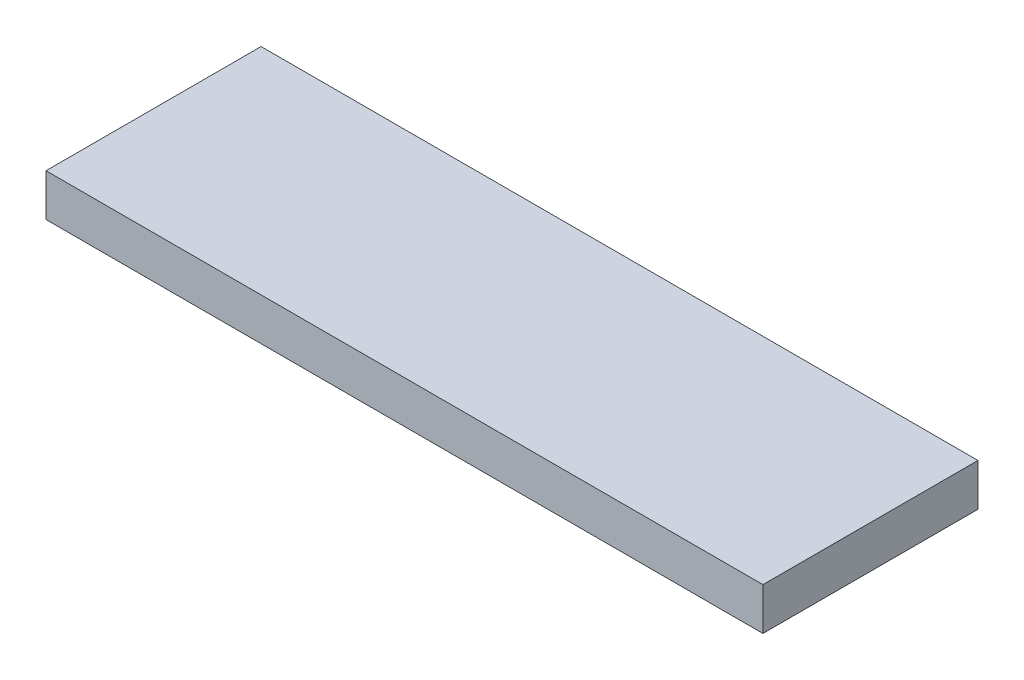
ISO-10303-21;
HEADER;
FILE_DESCRIPTION(('STEP AP214'),'2;1');
FILE_NAME('part.step','',(''),(''),'','','');
FILE_SCHEMA(('AUTOMOTIVE_DESIGN { 1 0 10303 214 1 1 1 1 }'));
ENDSEC;
DATA;
#1=APPLICATION_CONTEXT('core data for automotive mechanical design processes');
#2=APPLICATION_PROTOCOL_DEFINITION('international standard','automotive_design',2000,#1);
#3=PRODUCT_CONTEXT('',#1,'mechanical');
#4=PRODUCT('Part','Part','',(#3));
#5=PRODUCT_RELATED_PRODUCT_CATEGORY('part','',(#4));
#6=PRODUCT_DEFINITION_FORMATION('','',#4);
#7=PRODUCT_DEFINITION_CONTEXT('part definition',#1,'design');
#8=PRODUCT_DEFINITION('design','',#6,#7);
#9=PRODUCT_DEFINITION_SHAPE('','',#8);
#10=(LENGTH_UNIT() NAMED_UNIT(*) SI_UNIT(.MILLI.,.METRE.));
#11=(NAMED_UNIT(*) PLANE_ANGLE_UNIT() SI_UNIT($,.RADIAN.));
#12=(NAMED_UNIT(*) SI_UNIT($,.STERADIAN.) SOLID_ANGLE_UNIT());
#13=UNCERTAINTY_MEASURE_WITH_UNIT(LENGTH_MEASURE(1.E-05),#10,'distance_accuracy_value','');
#14=(GEOMETRIC_REPRESENTATION_CONTEXT(3) GLOBAL_UNCERTAINTY_ASSIGNED_CONTEXT((#13)) GLOBAL_UNIT_ASSIGNED_CONTEXT((#10,
#11,#12)) REPRESENTATION_CONTEXT('',''));
#15=CARTESIAN_POINT('',(0.,0.,0.));
#16=DIRECTION('',(0.,0.,1.));
#17=DIRECTION('',(1.,0.,0.));
#18=AXIS2_PLACEMENT_3D('',#15,#16,#17);
#19=CARTESIAN_POINT('',(-24.9461176470588,2.95,-33.0471764705882));
#20=DIRECTION('',(1.,0.,0.));
#21=DIRECTION('',(0.,0.,-1.));
#22=AXIS2_PLACEMENT_3D('',#19,#20,#21);
#23=PLANE('',#22);
#24=DIRECTION('',(0.,0.,1.));
#25=VECTOR('',#24,1.);
#26=CARTESIAN_POINT('',(-24.9461176470588,0.,-33.0471764705882));
#27=LINE('',#26,#25);
#28=CARTESIAN_POINT('',(-24.9461176470588,0.,-33.0471764705882));
#29=VERTEX_POINT('',#28);
#30=CARTESIAN_POINT('',(-24.9461176470588,0.,-18.0471764705882));
#31=VERTEX_POINT('',#30);
#32=EDGE_CURVE('E96',#29,#31,#27,.T.);
#33=ORIENTED_EDGE('',*,*,#32,.T.);
#34=DIRECTION('',(0.,-1.,0.));
#35=VECTOR('',#34,1.);
#36=CARTESIAN_POINT('',(-24.9461176470588,2.95,-18.0471764705882));
#37=LINE('',#36,#35);
#38=CARTESIAN_POINT('',(-24.9461176470588,2.95,-18.0471764705882));
#39=VERTEX_POINT('',#38);
#40=EDGE_CURVE('E11',#39,#31,#37,.T.);
#41=ORIENTED_EDGE('',*,*,#40,.F.);
#42=DIRECTION('',(0.,0.,1.));
#43=VECTOR('',#42,1.);
#44=CARTESIAN_POINT('',(-24.9461176470588,2.95,-33.0471764705882));
#45=LINE('',#44,#43);
#46=CARTESIAN_POINT('',(-24.9461176470588,2.95,-33.0471764705882));
#47=VERTEX_POINT('',#46);
#48=EDGE_CURVE('E84',#47,#39,#45,.T.);
#49=ORIENTED_EDGE('',*,*,#48,.F.);
#50=DIRECTION('',(0.,-1.,0.));
#51=VECTOR('',#50,1.);
#52=CARTESIAN_POINT('',(-24.9461176470588,2.95,-33.0471764705882));
#53=LINE('',#52,#51);
#54=EDGE_CURVE('E92',#47,#29,#53,.T.);
#55=ORIENTED_EDGE('',*,*,#54,.T.);
#56=EDGE_LOOP('',(#33,#41,#49,#55));
#57=FACE_BOUND('',#56,.T.);
#58=ADVANCED_FACE('F33',(#57),#23,.F.);
#59=CARTESIAN_POINT('',(-24.9461176470588,2.95,-18.0471764705882));
#60=DIRECTION('',(0.,0.,-1.));
#61=DIRECTION('',(-1.,0.,0.));
#62=AXIS2_PLACEMENT_3D('',#59,#60,#61);
#63=PLANE('',#62);
#64=DIRECTION('',(1.,0.,0.));
#65=VECTOR('',#64,1.);
#66=CARTESIAN_POINT('',(-24.9461176470588,0.,-18.0471764705882));
#67=LINE('',#66,#65);
#68=CARTESIAN_POINT('',(25.0538823529412,0.,-18.0471764705882));
#69=VERTEX_POINT('',#68);
#70=EDGE_CURVE('E88',#31,#69,#67,.T.);
#71=ORIENTED_EDGE('',*,*,#70,.T.);
#72=DIRECTION('',(0.,-1.,0.));
#73=VECTOR('',#72,1.);
#74=CARTESIAN_POINT('',(25.0538823529412,2.95,-18.0471764705882));
#75=LINE('',#74,#73);
#76=CARTESIAN_POINT('',(25.0538823529412,2.95,-18.0471764705882));
#77=VERTEX_POINT('',#76);
#78=EDGE_CURVE('E41',#77,#69,#75,.T.);
#79=ORIENTED_EDGE('',*,*,#78,.F.);
#80=DIRECTION('',(1.,0.,0.));
#81=VECTOR('',#80,1.);
#82=CARTESIAN_POINT('',(-24.9461176470588,2.95,-18.0471764705882));
#83=LINE('',#82,#81);
#84=EDGE_CURVE('E79',#39,#77,#83,.T.);
#85=ORIENTED_EDGE('',*,*,#84,.F.);
#86=ORIENTED_EDGE('',*,*,#40,.T.);
#87=EDGE_LOOP('',(#71,#79,#85,#86));
#88=FACE_BOUND('',#87,.T.);
#89=ADVANCED_FACE('F87',(#88),#63,.F.);
#90=CARTESIAN_POINT('',(25.0538823529412,2.95,-33.0471764705882));
#91=DIRECTION('',(-1.,0.,0.));
#92=DIRECTION('',(0.,0.,1.));
#93=AXIS2_PLACEMENT_3D('',#90,#91,#92);
#94=PLANE('',#93);
#95=DIRECTION('',(0.,0.,-1.));
#96=VECTOR('',#95,1.);
#97=CARTESIAN_POINT('',(25.0538823529412,0.,-33.0471764705882));
#98=LINE('',#97,#96);
#99=CARTESIAN_POINT('',(25.0538823529412,0.,-33.0471764705882));
#100=VERTEX_POINT('',#99);
#101=EDGE_CURVE('E66',#69,#100,#98,.T.);
#102=ORIENTED_EDGE('',*,*,#101,.T.);
#103=DIRECTION('',(0.,-1.,0.));
#104=VECTOR('',#103,1.);
#105=CARTESIAN_POINT('',(25.0538823529412,2.95,-33.0471764705882));
#106=LINE('',#105,#104);
#107=CARTESIAN_POINT('',(25.0538823529412,2.95,-33.0471764705882));
#108=VERTEX_POINT('',#107);
#109=EDGE_CURVE('E89',#108,#100,#106,.T.);
#110=ORIENTED_EDGE('',*,*,#109,.F.);
#111=DIRECTION('',(0.,0.,-1.));
#112=VECTOR('',#111,1.);
#113=CARTESIAN_POINT('',(25.0538823529412,2.95,-33.0471764705882));
#114=LINE('',#113,#112);
#115=EDGE_CURVE('E82',#77,#108,#114,.T.);
#116=ORIENTED_EDGE('',*,*,#115,.F.);
#117=ORIENTED_EDGE('',*,*,#78,.T.);
#118=EDGE_LOOP('',(#102,#110,#116,#117));
#119=FACE_BOUND('',#118,.T.);
#120=ADVANCED_FACE('F90',(#119),#94,.F.);
#121=CARTESIAN_POINT('',(-24.9461176470588,2.95,-33.0471764705882));
#122=DIRECTION('',(0.,0.,1.));
#123=DIRECTION('',(1.,0.,0.));
#124=AXIS2_PLACEMENT_3D('',#121,#122,#123);
#125=PLANE('',#124);
#126=DIRECTION('',(-1.,0.,0.));
#127=VECTOR('',#126,1.);
#128=CARTESIAN_POINT('',(-24.9461176470588,0.,-33.0471764705882));
#129=LINE('',#128,#127);
#130=EDGE_CURVE('E72',#100,#29,#129,.T.);
#131=ORIENTED_EDGE('',*,*,#130,.T.);
#132=ORIENTED_EDGE('',*,*,#54,.F.);
#133=DIRECTION('',(-1.,0.,0.));
#134=VECTOR('',#133,1.);
#135=CARTESIAN_POINT('',(-24.9461176470588,2.95,-33.0471764705882));
#136=LINE('',#135,#134);
#137=EDGE_CURVE('E49',#108,#47,#136,.T.);
#138=ORIENTED_EDGE('',*,*,#137,.F.);
#139=ORIENTED_EDGE('',*,*,#109,.T.);
#140=EDGE_LOOP('',(#131,#132,#138,#139));
#141=FACE_BOUND('',#140,.T.);
#142=ADVANCED_FACE('F103',(#141),#125,.F.);
#143=CARTESIAN_POINT('',(0.,2.95,0.));
#144=DIRECTION('',(0.,1.,0.));
#145=DIRECTION('',(0.,0.,1.));
#146=AXIS2_PLACEMENT_3D('',#143,#144,#145);
#147=PLANE('',#146);
#148=ORIENTED_EDGE('',*,*,#48,.T.);
#149=ORIENTED_EDGE('',*,*,#84,.T.);
#150=ORIENTED_EDGE('',*,*,#115,.T.);
#151=ORIENTED_EDGE('',*,*,#137,.T.);
#152=EDGE_LOOP('',(#148,#149,#150,#151));
#153=FACE_BOUND('',#152,.T.);
#154=ADVANCED_FACE('F80',(#153),#147,.T.);
#155=CARTESIAN_POINT('',(0.,0.,0.));
#156=DIRECTION('',(0.,1.,0.));
#157=DIRECTION('',(0.,0.,1.));
#158=AXIS2_PLACEMENT_3D('',#155,#156,#157);
#159=PLANE('',#158);
#160=ORIENTED_EDGE('',*,*,#32,.F.);
#161=ORIENTED_EDGE('',*,*,#130,.F.);
#162=ORIENTED_EDGE('',*,*,#101,.F.);
#163=ORIENTED_EDGE('',*,*,#70,.F.);
#164=EDGE_LOOP('',(#160,#161,#162,#163));
#165=FACE_BOUND('',#164,.T.);
#166=ADVANCED_FACE('F106',(#165),#159,.F.);
#167=CLOSED_SHELL('',(#58,#89,#120,#142,#154,#166));
#168=MANIFOLD_SOLID_BREP('B2',#167);
#169=ADVANCED_BREP_SHAPE_REPRESENTATION('',(#18,#168),#14);
#170=SHAPE_DEFINITION_REPRESENTATION(#9,#169);
ENDSEC;
END-ISO-10303-21;
